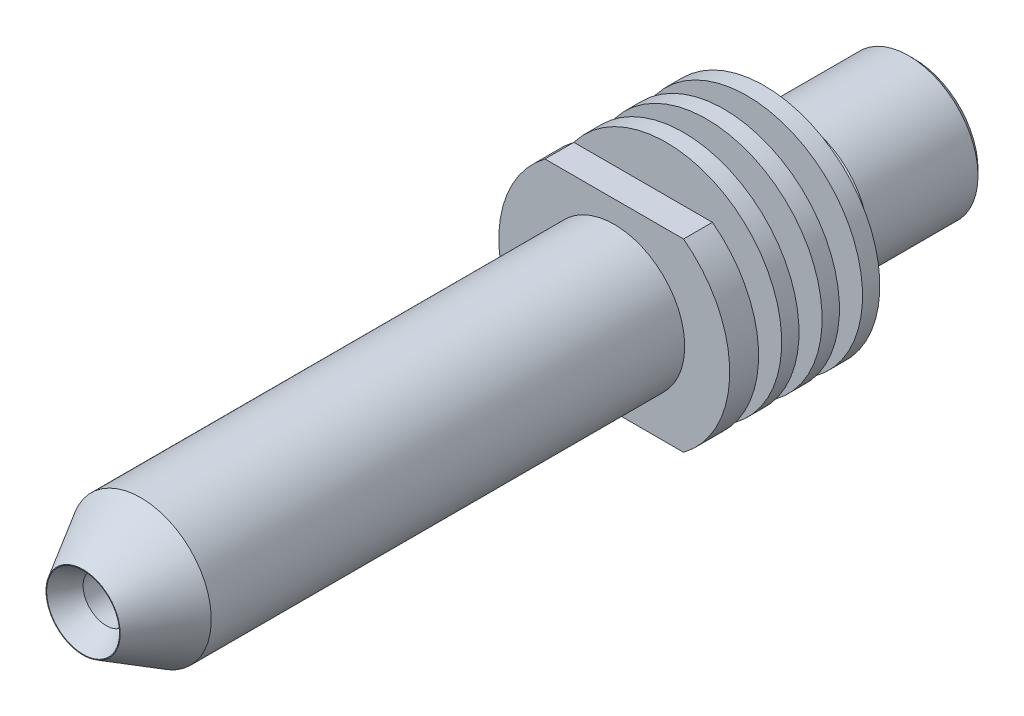
ISO-10303-21;
HEADER;
FILE_DESCRIPTION(('STEP AP214'),'2;1');
FILE_NAME('part.step','',(''),(''),'','','');
FILE_SCHEMA(('AUTOMOTIVE_DESIGN { 1 0 10303 214 1 1 1 1 }'));
ENDSEC;
DATA;
#1=APPLICATION_CONTEXT('core data for automotive mechanical design processes');
#2=APPLICATION_PROTOCOL_DEFINITION('international standard','automotive_design',2000,#1);
#3=PRODUCT_CONTEXT('',#1,'mechanical');
#4=PRODUCT('Part','Part','',(#3));
#5=PRODUCT_RELATED_PRODUCT_CATEGORY('part','',(#4));
#6=PRODUCT_DEFINITION_FORMATION('','',#4);
#7=PRODUCT_DEFINITION_CONTEXT('part definition',#1,'design');
#8=PRODUCT_DEFINITION('design','',#6,#7);
#9=PRODUCT_DEFINITION_SHAPE('','',#8);
#10=(LENGTH_UNIT() NAMED_UNIT(*) SI_UNIT(.MILLI.,.METRE.));
#11=(NAMED_UNIT(*) PLANE_ANGLE_UNIT() SI_UNIT($,.RADIAN.));
#12=(NAMED_UNIT(*) SI_UNIT($,.STERADIAN.) SOLID_ANGLE_UNIT());
#13=UNCERTAINTY_MEASURE_WITH_UNIT(LENGTH_MEASURE(1.E-05),#10,'distance_accuracy_value','');
#14=(GEOMETRIC_REPRESENTATION_CONTEXT(3) GLOBAL_UNCERTAINTY_ASSIGNED_CONTEXT((#13)) GLOBAL_UNIT_ASSIGNED_CONTEXT((#10,
#11,#12)) REPRESENTATION_CONTEXT('',''));
#15=CARTESIAN_POINT('',(0.,0.,0.));
#16=DIRECTION('',(0.,0.,1.));
#17=DIRECTION('',(1.,0.,0.));
#18=AXIS2_PLACEMENT_3D('',#15,#16,#17);
#19=CARTESIAN_POINT('',(-0.2166088223,-17.0652643177,145.88));
#20=DIRECTION('',(0.,0.,1.));
#21=DIRECTION('',(1.,0.,0.));
#22=AXIS2_PLACEMENT_3D('',#19,#20,#21);
#23=PLANE('',#22);
#24=CARTESIAN_POINT('',(-0.2166088223,-17.0652643177,145.88));
#25=DIRECTION('',(0.,0.,-1.));
#26=DIRECTION('',(-1.,0.,0.));
#27=AXIS2_PLACEMENT_3D('',#24,#25,#26);
#28=CIRCLE('',#27,5.);
#29=CARTESIAN_POINT('',(-5.2166088223,-17.0652643177,145.88));
#30=VERTEX_POINT('',#29);
#31=EDGE_CURVE('E19',#30,#30,#28,.T.);
#32=ORIENTED_EDGE('',*,*,#31,.F.);
#33=EDGE_LOOP('',(#32));
#34=FACE_BOUND('',#33,.T.);
#35=CARTESIAN_POINT('',(-0.216608822300001,-17.0652643177,145.88));
#36=DIRECTION('',(0.,0.,-1.));
#37=DIRECTION('',(-1.,0.,0.));
#38=AXIS2_PLACEMENT_3D('',#35,#36,#37);
#39=CIRCLE('',#38,3.);
#40=CARTESIAN_POINT('',(-3.2166088223,-17.0652643177,145.88));
#41=VERTEX_POINT('',#40);
#42=EDGE_CURVE('E155',#41,#41,#39,.F.);
#43=ORIENTED_EDGE('',*,*,#42,.F.);
#44=EDGE_LOOP('',(#43));
#45=FACE_BOUND('',#44,.T.);
#46=ADVANCED_FACE('F16',(#34,#45),#23,.T.);
#47=CARTESIAN_POINT('',(-0.2166088223,-17.0652643177,145.88));
#48=DIRECTION('',(0.,0.,-1.));
#49=DIRECTION('',(-1.,0.,0.));
#50=AXIS2_PLACEMENT_3D('',#47,#48,#49);
#51=CYLINDRICAL_SURFACE('',#50,5.);
#52=CARTESIAN_POINT('',(-0.216608822300001,-17.0652643177,145.13));
#53=DIRECTION('',(0.,0.,-1.));
#54=DIRECTION('',(-1.,0.,0.));
#55=AXIS2_PLACEMENT_3D('',#52,#53,#54);
#56=CIRCLE('',#55,5.);
#57=CARTESIAN_POINT('',(-5.2166088223,-17.0652643177,145.13));
#58=VERTEX_POINT('',#57);
#59=EDGE_CURVE('E153',#58,#58,#56,.F.);
#60=ORIENTED_EDGE('',*,*,#59,.T.);
#61=EDGE_LOOP('',(#60));
#62=FACE_BOUND('',#61,.T.);
#63=ORIENTED_EDGE('',*,*,#31,.T.);
#64=EDGE_LOOP('',(#63));
#65=FACE_BOUND('',#64,.T.);
#66=ADVANCED_FACE('F162',(#62,#65),#51,.T.);
#67=CARTESIAN_POINT('',(-0.2166088223,-17.0652643177,146.88));
#68=DIRECTION('',(0.,0.,-1.));
#69=DIRECTION('',(-1.,0.,0.));
#70=AXIS2_PLACEMENT_3D('',#67,#68,#69);
#71=CYLINDRICAL_SURFACE('',#70,3.);
#72=ORIENTED_EDGE('',*,*,#42,.T.);
#73=EDGE_LOOP('',(#72));
#74=FACE_BOUND('',#73,.T.);
#75=CARTESIAN_POINT('',(-0.2166088223,-17.0652643177,146.88));
#76=DIRECTION('',(0.,0.,-1.));
#77=DIRECTION('',(-1.,0.,0.));
#78=AXIS2_PLACEMENT_3D('',#75,#76,#77);
#79=CIRCLE('',#78,3.);
#80=CARTESIAN_POINT('',(-3.2166088223,-17.0652643177,146.88));
#81=VERTEX_POINT('',#80);
#82=EDGE_CURVE('E150',#81,#81,#79,.T.);
#83=ORIENTED_EDGE('',*,*,#82,.T.);
#84=EDGE_LOOP('',(#83));
#85=FACE_BOUND('',#84,.T.);
#86=ADVANCED_FACE('F170',(#74,#85),#71,.T.);
#87=CARTESIAN_POINT('',(-0.2166088223,-17.0652643177,145.13));
#88=DIRECTION('',(0.,0.,1.));
#89=DIRECTION('',(1.,0.,0.));
#90=AXIS2_PLACEMENT_3D('',#87,#88,#89);
#91=PLANE('',#90);
#92=CARTESIAN_POINT('',(-0.2166088223,-17.0652643177,145.13));
#93=DIRECTION('',(0.,0.,-1.));
#94=DIRECTION('',(-1.,0.,0.));
#95=AXIS2_PLACEMENT_3D('',#92,#93,#94);
#96=CIRCLE('',#95,2.75);
#97=CARTESIAN_POINT('',(-2.9666088223,-17.0652643177,145.13));
#98=VERTEX_POINT('',#97);
#99=EDGE_CURVE('E147',#98,#98,#96,.T.);
#100=ORIENTED_EDGE('',*,*,#99,.F.);
#101=EDGE_LOOP('',(#100));
#102=FACE_BOUND('',#101,.T.);
#103=ORIENTED_EDGE('',*,*,#59,.F.);
#104=EDGE_LOOP('',(#103));
#105=FACE_BOUND('',#104,.T.);
#106=ADVANCED_FACE('F273',(#102,#105),#91,.F.);
#107=CARTESIAN_POINT('',(-0.2166088223,-17.0652643177,146.88));
#108=DIRECTION('',(0.,0.,1.));
#109=DIRECTION('',(1.,0.,0.));
#110=AXIS2_PLACEMENT_3D('',#107,#108,#109);
#111=PLANE('',#110);
#112=ORIENTED_EDGE('',*,*,#82,.F.);
#113=EDGE_LOOP('',(#112));
#114=FACE_BOUND('',#113,.T.);
#115=CARTESIAN_POINT('',(-0.216608822300001,-17.0652643177,146.88));
#116=DIRECTION('',(0.,0.,-1.));
#117=DIRECTION('',(-1.,0.,0.));
#118=AXIS2_PLACEMENT_3D('',#115,#116,#117);
#119=CIRCLE('',#118,5.);
#120=CARTESIAN_POINT('',(-5.2166088223,-17.0652643177,146.88));
#121=VERTEX_POINT('',#120);
#122=EDGE_CURVE('E107',#121,#121,#119,.F.);
#123=ORIENTED_EDGE('',*,*,#122,.F.);
#124=EDGE_LOOP('',(#123));
#125=FACE_BOUND('',#124,.T.);
#126=ADVANCED_FACE('F269',(#114,#125),#111,.F.);
#127=CARTESIAN_POINT('',(-0.2166088223,-17.0652643177,145.13));
#128=DIRECTION('',(0.,0.,-1.));
#129=DIRECTION('',(-1.,0.,0.));
#130=AXIS2_PLACEMENT_3D('',#127,#128,#129);
#131=CYLINDRICAL_SURFACE('',#130,2.75);
#132=CARTESIAN_POINT('',(-0.2166088223,-17.0652643177,143.880000000024));
#133=DIRECTION('',(0.,0.,-1.));
#134=DIRECTION('',(0.,1.,0.));
#135=AXIS2_PLACEMENT_3D('',#132,#133,#134);
#136=CIRCLE('',#135,2.75000000005504);
#137=CARTESIAN_POINT('',(-0.216608822299999,-14.315264317645,143.880000000024));
#138=VERTEX_POINT('',#137);
#139=EDGE_CURVE('E104',#138,#138,#136,.T.);
#140=ORIENTED_EDGE('',*,*,#139,.F.);
#141=EDGE_LOOP('',(#140));
#142=FACE_BOUND('',#141,.T.);
#143=ORIENTED_EDGE('',*,*,#99,.T.);
#144=EDGE_LOOP('',(#143));
#145=FACE_BOUND('',#144,.T.);
#146=ADVANCED_FACE('F265',(#142,#145),#131,.T.);
#147=CARTESIAN_POINT('',(-0.2166088223,-17.0652643177,147.63));
#148=DIRECTION('',(0.,0.,-1.));
#149=DIRECTION('',(-1.,0.,0.));
#150=AXIS2_PLACEMENT_3D('',#147,#148,#149);
#151=CYLINDRICAL_SURFACE('',#150,5.);
#152=ORIENTED_EDGE('',*,*,#122,.T.);
#153=EDGE_LOOP('',(#152));
#154=FACE_BOUND('',#153,.T.);
#155=CARTESIAN_POINT('',(-0.2166088223,-17.0652643177,147.63));
#156=DIRECTION('',(0.,0.,-1.));
#157=DIRECTION('',(-1.,0.,0.));
#158=AXIS2_PLACEMENT_3D('',#155,#156,#157);
#159=CIRCLE('',#158,5.);
#160=CARTESIAN_POINT('',(-5.2166088223,-17.0652643177,147.63));
#161=VERTEX_POINT('',#160);
#162=EDGE_CURVE('E99',#161,#161,#159,.F.);
#163=ORIENTED_EDGE('',*,*,#162,.F.);
#164=EDGE_LOOP('',(#163));
#165=FACE_BOUND('',#164,.T.);
#166=ADVANCED_FACE('F261',(#154,#165),#151,.T.);
#167=CARTESIAN_POINT('',(-0.2166088223,-17.0652643177,143.63000000003));
#168=DIRECTION('',(0.,0.,-1.));
#169=DIRECTION('',(-1.,0.,0.));
#170=AXIS2_PLACEMENT_3D('',#167,#168,#169);
#171=CONICAL_SURFACE('',#170,3.00000000004913,0.785398163397448);
#172=CARTESIAN_POINT('',(-0.2166088223,-17.0652643177,143.63));
#173=DIRECTION('',(0.,0.,-1.));
#174=DIRECTION('',(-1.,0.,0.));
#175=AXIS2_PLACEMENT_3D('',#172,#173,#174);
#176=CIRCLE('',#175,3.);
#177=CARTESIAN_POINT('',(-3.2166088223,-17.0652643177,143.63));
#178=VERTEX_POINT('',#177);
#179=EDGE_CURVE('E95',#178,#178,#176,.T.);
#180=ORIENTED_EDGE('',*,*,#179,.F.);
#181=EDGE_LOOP('',(#180));
#182=FACE_BOUND('',#181,.T.);
#183=ORIENTED_EDGE('',*,*,#139,.T.);
#184=EDGE_LOOP('',(#183));
#185=FACE_BOUND('',#184,.T.);
#186=ADVANCED_FACE('F257',(#182,#185),#171,.T.);
#187=CARTESIAN_POINT('',(-0.2166088223,-17.0652643177,147.63));
#188=DIRECTION('',(0.,0.,1.));
#189=DIRECTION('',(1.,0.,0.));
#190=AXIS2_PLACEMENT_3D('',#187,#188,#189);
#191=PLANE('',#190);
#192=ORIENTED_EDGE('',*,*,#162,.T.);
#193=EDGE_LOOP('',(#192));
#194=FACE_BOUND('',#193,.T.);
#195=CARTESIAN_POINT('',(-0.216608822300001,-17.0652643177,147.63));
#196=DIRECTION('',(0.,0.,-1.));
#197=DIRECTION('',(-1.,0.,0.));
#198=AXIS2_PLACEMENT_3D('',#195,#196,#197);
#199=CIRCLE('',#198,3.);
#200=CARTESIAN_POINT('',(-3.2166088223,-17.0652643177,147.63));
#201=VERTEX_POINT('',#200);
#202=EDGE_CURVE('E98',#201,#201,#199,.F.);
#203=ORIENTED_EDGE('',*,*,#202,.F.);
#204=EDGE_LOOP('',(#203));
#205=FACE_BOUND('',#204,.T.);
#206=ADVANCED_FACE('F253',(#194,#205),#191,.T.);
#207=CARTESIAN_POINT('',(-0.2166088223,-17.0652643177,143.63));
#208=DIRECTION('',(0.,0.,-1.));
#209=DIRECTION('',(-1.,0.,0.));
#210=AXIS2_PLACEMENT_3D('',#207,#208,#209);
#211=CYLINDRICAL_SURFACE('',#210,3.);
#212=CARTESIAN_POINT('',(-0.2166088223,-17.0652643177,138.879999999972));
#213=DIRECTION('',(0.,0.,1.));
#214=DIRECTION('',(0.,1.,0.));
#215=AXIS2_PLACEMENT_3D('',#212,#213,#214);
#216=CIRCLE('',#215,2.99999999999228);
#217=CARTESIAN_POINT('',(-0.2166088223,-14.0652643177077,138.879999999972));
#218=VERTEX_POINT('',#217);
#219=EDGE_CURVE('E100',#218,#218,#216,.F.);
#220=ORIENTED_EDGE('',*,*,#219,.F.);
#221=EDGE_LOOP('',(#220));
#222=FACE_BOUND('',#221,.T.);
#223=ORIENTED_EDGE('',*,*,#179,.T.);
#224=EDGE_LOOP('',(#223));
#225=FACE_BOUND('',#224,.T.);
#226=ADVANCED_FACE('F249',(#222,#225),#211,.T.);
#227=CARTESIAN_POINT('',(-0.2166088223,-17.0652643177,148.63));
#228=DIRECTION('',(0.,0.,-1.));
#229=DIRECTION('',(-1.,0.,0.));
#230=AXIS2_PLACEMENT_3D('',#227,#228,#229);
#231=CYLINDRICAL_SURFACE('',#230,3.);
#232=ORIENTED_EDGE('',*,*,#202,.T.);
#233=EDGE_LOOP('',(#232));
#234=FACE_BOUND('',#233,.T.);
#235=CARTESIAN_POINT('',(-0.2166088223,-17.0652643177,148.63));
#236=DIRECTION('',(0.,0.,-1.));
#237=DIRECTION('',(-1.,0.,0.));
#238=AXIS2_PLACEMENT_3D('',#235,#236,#237);
#239=CIRCLE('',#238,3.);
#240=CARTESIAN_POINT('',(-3.2166088223,-17.0652643177,148.63));
#241=VERTEX_POINT('',#240);
#242=EDGE_CURVE('E103',#241,#241,#239,.T.);
#243=ORIENTED_EDGE('',*,*,#242,.T.);
#244=EDGE_LOOP('',(#243));
#245=FACE_BOUND('',#244,.T.);
#246=ADVANCED_FACE('F245',(#234,#245),#231,.T.);
#247=CARTESIAN_POINT('',(-0.2166088223,-17.0652643177,138.879999999972));
#248=DIRECTION('',(0.,0.,1.));
#249=DIRECTION('',(1.,0.,0.));
#250=AXIS2_PLACEMENT_3D('',#247,#248,#249);
#251=CONICAL_SURFACE('',#250,2.99999999999228,0.785398163397448);
#252=CARTESIAN_POINT('',(-0.2166088223,-17.0652643177,138.629999999978));
#253=DIRECTION('',(0.,0.,1.));
#254=DIRECTION('',(1.,0.,0.));
#255=AXIS2_PLACEMENT_3D('',#252,#253,#254);
#256=CIRCLE('',#255,2.74999999999819);
#257=CARTESIAN_POINT('',(2.53339117769819,-17.0652643177,138.629999999978));
#258=VERTEX_POINT('',#257);
#259=EDGE_CURVE('E136',#258,#258,#256,.T.);
#260=ORIENTED_EDGE('',*,*,#259,.T.);
#261=EDGE_LOOP('',(#260));
#262=FACE_BOUND('',#261,.T.);
#263=ORIENTED_EDGE('',*,*,#219,.T.);
#264=EDGE_LOOP('',(#263));
#265=FACE_BOUND('',#264,.T.);
#266=ADVANCED_FACE('F241',(#262,#265),#251,.T.);
#267=CARTESIAN_POINT('',(-0.2166088223,-17.0652643177,148.63));
#268=DIRECTION('',(0.,0.,1.));
#269=DIRECTION('',(1.,0.,0.));
#270=AXIS2_PLACEMENT_3D('',#267,#268,#269);
#271=PLANE('',#270);
#272=ORIENTED_EDGE('',*,*,#242,.F.);
#273=EDGE_LOOP('',(#272));
#274=FACE_BOUND('',#273,.T.);
#275=CARTESIAN_POINT('',(-0.216608822300001,-17.0652643177,148.63));
#276=DIRECTION('',(0.,0.,-1.));
#277=DIRECTION('',(-1.,0.,0.));
#278=AXIS2_PLACEMENT_3D('',#275,#276,#277);
#279=CIRCLE('',#278,5.);
#280=CARTESIAN_POINT('',(-5.2166088223,-17.0652643177,148.63));
#281=VERTEX_POINT('',#280);
#282=EDGE_CURVE('E133',#281,#281,#279,.F.);
#283=ORIENTED_EDGE('',*,*,#282,.F.);
#284=EDGE_LOOP('',(#283));
#285=FACE_BOUND('',#284,.T.);
#286=ADVANCED_FACE('F237',(#274,#285),#271,.F.);
#287=CARTESIAN_POINT('',(-0.2166088223,-17.0652643177,138.63));
#288=DIRECTION('',(0.,0.,1.));
#289=DIRECTION('',(1.,0.,0.));
#290=AXIS2_PLACEMENT_3D('',#287,#288,#289);
#291=PLANE('',#290);
#292=CARTESIAN_POINT('',(-0.2166088223,-17.0652643177,138.63));
#293=DIRECTION('',(0.,0.,1.));
#294=DIRECTION('',(1.,0.,0.));
#295=AXIS2_PLACEMENT_3D('',#292,#293,#294);
#296=CIRCLE('',#295,2.);
#297=CARTESIAN_POINT('',(1.7833911777,-17.0652643177,138.63));
#298=VERTEX_POINT('',#297);
#299=EDGE_CURVE('E130',#298,#298,#296,.T.);
#300=ORIENTED_EDGE('',*,*,#299,.T.);
#301=EDGE_LOOP('',(#300));
#302=FACE_BOUND('',#301,.T.);
#303=ORIENTED_EDGE('',*,*,#259,.F.);
#304=EDGE_LOOP('',(#303));
#305=FACE_BOUND('',#304,.T.);
#306=ADVANCED_FACE('F233',(#302,#305),#291,.F.);
#307=CARTESIAN_POINT('',(-0.2166088223,-17.0652643177,149.38));
#308=DIRECTION('',(0.,0.,-1.));
#309=DIRECTION('',(-1.,0.,0.));
#310=AXIS2_PLACEMENT_3D('',#307,#308,#309);
#311=CYLINDRICAL_SURFACE('',#310,5.);
#312=ORIENTED_EDGE('',*,*,#282,.T.);
#313=EDGE_LOOP('',(#312));
#314=FACE_BOUND('',#313,.T.);
#315=CARTESIAN_POINT('',(-0.2166088223,-17.0652643177,149.38));
#316=DIRECTION('',(0.,0.,-1.));
#317=DIRECTION('',(-1.,0.,0.));
#318=AXIS2_PLACEMENT_3D('',#315,#316,#317);
#319=CIRCLE('',#318,5.);
#320=CARTESIAN_POINT('',(-5.2166088223,-17.0652643177,149.38));
#321=VERTEX_POINT('',#320);
#322=EDGE_CURVE('E94',#321,#321,#319,.F.);
#323=ORIENTED_EDGE('',*,*,#322,.F.);
#324=EDGE_LOOP('',(#323));
#325=FACE_BOUND('',#324,.T.);
#326=ADVANCED_FACE('F229',(#314,#325),#311,.T.);
#327=CARTESIAN_POINT('',(-0.2166088223,-17.0652643177,138.63));
#328=DIRECTION('',(0.,0.,1.));
#329=DIRECTION('',(1.,0.,0.));
#330=AXIS2_PLACEMENT_3D('',#327,#328,#329);
#331=CYLINDRICAL_SURFACE('',#330,2.);
#332=CARTESIAN_POINT('',(-0.2166088223,-17.0652643177,169.629999999984));
#333=DIRECTION('',(0.,0.,-1.));
#334=DIRECTION('',(0.,1.,0.));
#335=AXIS2_PLACEMENT_3D('',#332,#333,#334);
#336=CIRCLE('',#335,2.00000000001593);
#337=CARTESIAN_POINT('',(-0.216608822299993,-15.0652643176841,169.629999999984));
#338=VERTEX_POINT('',#337);
#339=EDGE_CURVE('E91',#338,#338,#336,.F.);
#340=ORIENTED_EDGE('',*,*,#339,.T.);
#341=EDGE_LOOP('',(#340));
#342=FACE_BOUND('',#341,.T.);
#343=ORIENTED_EDGE('',*,*,#299,.F.);
#344=EDGE_LOOP('',(#343));
#345=FACE_BOUND('',#344,.T.);
#346=ADVANCED_FACE('F225',(#342,#345),#331,.F.);
#347=CARTESIAN_POINT('',(-0.2166088223,-17.0652643177,149.38));
#348=DIRECTION('',(0.,0.,1.));
#349=DIRECTION('',(1.,0.,0.));
#350=AXIS2_PLACEMENT_3D('',#347,#348,#349);
#351=PLANE('',#350);
#352=ORIENTED_EDGE('',*,*,#322,.T.);
#353=EDGE_LOOP('',(#352));
#354=FACE_BOUND('',#353,.T.);
#355=CARTESIAN_POINT('',(-0.216608822300001,-17.0652643177,149.38));
#356=DIRECTION('',(0.,0.,-1.));
#357=DIRECTION('',(-1.,0.,0.));
#358=AXIS2_PLACEMENT_3D('',#355,#356,#357);
#359=CIRCLE('',#358,3.);
#360=CARTESIAN_POINT('',(-3.2166088223,-17.0652643177,149.38));
#361=VERTEX_POINT('',#360);
#362=EDGE_CURVE('E88',#361,#361,#359,.F.);
#363=ORIENTED_EDGE('',*,*,#362,.F.);
#364=EDGE_LOOP('',(#363));
#365=FACE_BOUND('',#364,.T.);
#366=ADVANCED_FACE('F221',(#354,#365),#351,.T.);
#367=CARTESIAN_POINT('',(-0.2166088223,-17.0652643177,169.629999999984));
#368=DIRECTION('',(0.,0.,-1.));
#369=DIRECTION('',(-1.,0.,0.));
#370=AXIS2_PLACEMENT_3D('',#367,#368,#369);
#371=CONICAL_SURFACE('',#370,2.00000000001593,1.04719755120245);
#372=CARTESIAN_POINT('',(-0.2166088223,-17.0652643177,170.20735026919));
#373=DIRECTION('',(0.,0.,1.));
#374=DIRECTION('',(1.,0.,0.));
#375=AXIS2_PLACEMENT_3D('',#372,#373,#374);
#376=CIRCLE('',#375,1.);
#377=CARTESIAN_POINT('',(0.7833911777,-17.0652643177,170.20735026919));
#378=VERTEX_POINT('',#377);
#379=EDGE_CURVE('E84',#378,#378,#376,.T.);
#380=ORIENTED_EDGE('',*,*,#379,.T.);
#381=EDGE_LOOP('',(#380));
#382=FACE_BOUND('',#381,.T.);
#383=ORIENTED_EDGE('',*,*,#339,.F.);
#384=EDGE_LOOP('',(#383));
#385=FACE_BOUND('',#384,.T.);
#386=ADVANCED_FACE('F217',(#382,#385),#371,.F.);
#387=CARTESIAN_POINT('',(-0.2166088223,-17.0652643177,150.38));
#388=DIRECTION('',(0.,0.,-1.));
#389=DIRECTION('',(-1.,0.,0.));
#390=AXIS2_PLACEMENT_3D('',#387,#388,#389);
#391=CYLINDRICAL_SURFACE('',#390,3.);
#392=ORIENTED_EDGE('',*,*,#362,.T.);
#393=EDGE_LOOP('',(#392));
#394=FACE_BOUND('',#393,.T.);
#395=CARTESIAN_POINT('',(-0.2166088223,-17.0652643177,150.38));
#396=DIRECTION('',(0.,0.,-1.));
#397=DIRECTION('',(-1.,0.,0.));
#398=AXIS2_PLACEMENT_3D('',#395,#396,#397);
#399=CIRCLE('',#398,3.);
#400=CARTESIAN_POINT('',(-3.2166088223,-17.0652643177,150.38));
#401=VERTEX_POINT('',#400);
#402=EDGE_CURVE('E87',#401,#401,#399,.T.);
#403=ORIENTED_EDGE('',*,*,#402,.T.);
#404=EDGE_LOOP('',(#403));
#405=FACE_BOUND('',#404,.T.);
#406=ADVANCED_FACE('F213',(#394,#405),#391,.T.);
#407=CARTESIAN_POINT('',(-0.2166088223,-17.0652643177,170.20735026919));
#408=DIRECTION('',(0.,0.,1.));
#409=DIRECTION('',(1.,0.,0.));
#410=AXIS2_PLACEMENT_3D('',#407,#408,#409);
#411=CYLINDRICAL_SURFACE('',#410,1.);
#412=CARTESIAN_POINT('',(-0.2166088223,-17.0652643177,173.629999999946));
#413=DIRECTION('',(0.,0.,1.));
#414=DIRECTION('',(0.,1.,0.));
#415=AXIS2_PLACEMENT_3D('',#412,#413,#414);
#416=CIRCLE('',#415,0.999999999982733);
#417=CARTESIAN_POINT('',(-0.216608822299992,-16.0652643177173,173.629999999946));
#418=VERTEX_POINT('',#417);
#419=EDGE_CURVE('E83',#418,#418,#416,.T.);
#420=ORIENTED_EDGE('',*,*,#419,.T.);
#421=EDGE_LOOP('',(#420));
#422=FACE_BOUND('',#421,.T.);
#423=ORIENTED_EDGE('',*,*,#379,.F.);
#424=EDGE_LOOP('',(#423));
#425=FACE_BOUND('',#424,.T.);
#426=ADVANCED_FACE('F209',(#422,#425),#411,.F.);
#427=CARTESIAN_POINT('',(-0.2166088223,-17.0652643177,150.38));
#428=DIRECTION('',(0.,0.,1.));
#429=DIRECTION('',(1.,0.,0.));
#430=AXIS2_PLACEMENT_3D('',#427,#428,#429);
#431=PLANE('',#430);
#432=ORIENTED_EDGE('',*,*,#402,.F.);
#433=EDGE_LOOP('',(#432));
#434=FACE_BOUND('',#433,.T.);
#435=DIRECTION('',(1.,0.,0.));
#436=VECTOR('',#435,1.);
#437=CARTESIAN_POINT('',(-4.7166088223,-21.0652643177,150.38));
#438=LINE('',#437,#436);
#439=CARTESIAN_POINT('',(-3.2166088223,-21.0652643177,150.38));
#440=VERTEX_POINT('',#439);
#441=CARTESIAN_POINT('',(2.7833911777,-21.0652643177,150.38));
#442=VERTEX_POINT('',#441);
#443=EDGE_CURVE('E54',#440,#442,#438,.T.);
#444=ORIENTED_EDGE('',*,*,#443,.F.);
#445=CARTESIAN_POINT('',(-0.216608822300001,-17.0652643177,150.38));
#446=DIRECTION('',(0.,0.,-1.));
#447=DIRECTION('',(-1.,0.,0.));
#448=AXIS2_PLACEMENT_3D('',#445,#446,#447);
#449=CIRCLE('',#448,5.);
#450=CARTESIAN_POINT('',(-3.2166088223,-13.0652643177,150.38));
#451=VERTEX_POINT('',#450);
#452=EDGE_CURVE('E71',#451,#440,#449,.F.);
#453=ORIENTED_EDGE('',*,*,#452,.F.);
#454=DIRECTION('',(1.,0.,0.));
#455=VECTOR('',#454,1.);
#456=CARTESIAN_POINT('',(4.2833911777,-13.0652643177,150.38));
#457=LINE('',#456,#455);
#458=CARTESIAN_POINT('',(2.7833911777,-13.0652643177,150.38));
#459=VERTEX_POINT('',#458);
#460=EDGE_CURVE('E68',#459,#451,#457,.F.);
#461=ORIENTED_EDGE('',*,*,#460,.F.);
#462=CARTESIAN_POINT('',(-0.216608822300001,-17.0652643177,150.38));
#463=DIRECTION('',(0.,0.,-1.));
#464=DIRECTION('',(-1.,0.,0.));
#465=AXIS2_PLACEMENT_3D('',#462,#463,#464);
#466=CIRCLE('',#465,5.);
#467=EDGE_CURVE('E59',#442,#459,#466,.F.);
#468=ORIENTED_EDGE('',*,*,#467,.F.);
#469=EDGE_LOOP('',(#444,#453,#461,#468));
#470=FACE_BOUND('',#469,.T.);
#471=ADVANCED_FACE('F69',(#434,#470),#431,.F.);
#472=CARTESIAN_POINT('',(-0.216608822299999,-17.0652643177,174.629999999979));
#473=DIRECTION('',(0.,0.,1.));
#474=DIRECTION('',(1.,0.,0.));
#475=AXIS2_PLACEMENT_3D('',#472,#473,#474);
#476=CONICAL_SURFACE('',#475,1.57735026920774,0.523598775610461);
#477=CARTESIAN_POINT('',(-0.216608822299999,-17.0652643177,174.629999999979));
#478=DIRECTION('',(0.,0.,1.));
#479=DIRECTION('',(1.,0.,0.));
#480=AXIS2_PLACEMENT_3D('',#477,#478,#479);
#481=CIRCLE('',#480,1.57735026920774);
#482=CARTESIAN_POINT('',(1.36074144690774,-17.0652643177,174.629999999979));
#483=VERTEX_POINT('',#482);
#484=EDGE_CURVE('E119',#483,#483,#481,.F.);
#485=ORIENTED_EDGE('',*,*,#484,.F.);
#486=EDGE_LOOP('',(#485));
#487=FACE_BOUND('',#486,.T.);
#488=ORIENTED_EDGE('',*,*,#419,.F.);
#489=EDGE_LOOP('',(#488));
#490=FACE_BOUND('',#489,.T.);
#491=ADVANCED_FACE('F203',(#487,#490),#476,.F.);
#492=CARTESIAN_POINT('',(-4.7166088223,-21.0652643177,151.63));
#493=DIRECTION('',(0.,-1.,0.));
#494=DIRECTION('',(0.,0.,-1.));
#495=AXIS2_PLACEMENT_3D('',#492,#493,#494);
#496=PLANE('',#495);
#497=ORIENTED_EDGE('',*,*,#443,.T.);
#498=DIRECTION('',(0.,0.,-1.));
#499=VECTOR('',#498,1.);
#500=CARTESIAN_POINT('',(2.7833911777,-21.0652643177,151.63));
#501=LINE('',#500,#499);
#502=CARTESIAN_POINT('',(2.7833911777,-21.0652643177,151.63));
#503=VERTEX_POINT('',#502);
#504=EDGE_CURVE('E65',#503,#442,#501,.T.);
#505=ORIENTED_EDGE('',*,*,#504,.F.);
#506=DIRECTION('',(1.,0.,0.));
#507=VECTOR('',#506,1.);
#508=CARTESIAN_POINT('',(-0.2166088223,-21.0652643177,151.63));
#509=LINE('',#508,#507);
#510=CARTESIAN_POINT('',(-3.2166088223,-21.0652643177,151.63));
#511=VERTEX_POINT('',#510);
#512=EDGE_CURVE('E118',#511,#503,#509,.T.);
#513=ORIENTED_EDGE('',*,*,#512,.F.);
#514=DIRECTION('',(0.,0.,-1.));
#515=VECTOR('',#514,1.);
#516=CARTESIAN_POINT('',(-3.2166088223,-21.0652643177,151.63));
#517=LINE('',#516,#515);
#518=EDGE_CURVE('E122',#440,#511,#517,.F.);
#519=ORIENTED_EDGE('',*,*,#518,.F.);
#520=EDGE_LOOP('',(#497,#505,#513,#519));
#521=FACE_BOUND('',#520,.T.);
#522=ADVANCED_FACE('F200',(#521),#496,.T.);
#523=CARTESIAN_POINT('',(-0.2166088223,-17.0652643177,151.63));
#524=DIRECTION('',(0.,0.,-1.));
#525=DIRECTION('',(-1.,0.,0.));
#526=AXIS2_PLACEMENT_3D('',#523,#524,#525);
#527=CYLINDRICAL_SURFACE('',#526,5.);
#528=DIRECTION('',(0.,0.,1.));
#529=VECTOR('',#528,1.);
#530=CARTESIAN_POINT('',(2.7833911777,-13.0652643177,151.63));
#531=LINE('',#530,#529);
#532=CARTESIAN_POINT('',(2.7833911777,-13.0652643177,151.63));
#533=VERTEX_POINT('',#532);
#534=EDGE_CURVE('E64',#533,#459,#531,.F.);
#535=ORIENTED_EDGE('',*,*,#534,.F.);
#536=CARTESIAN_POINT('',(-0.2166088223,-17.0652643177,151.63));
#537=DIRECTION('',(0.,0.,-1.));
#538=DIRECTION('',(-1.,0.,0.));
#539=AXIS2_PLACEMENT_3D('',#536,#537,#538);
#540=CIRCLE('',#539,5.);
#541=EDGE_CURVE('E116',#503,#533,#540,.F.);
#542=ORIENTED_EDGE('',*,*,#541,.F.);
#543=ORIENTED_EDGE('',*,*,#504,.T.);
#544=ORIENTED_EDGE('',*,*,#467,.T.);
#545=EDGE_LOOP('',(#535,#542,#543,#544));
#546=FACE_BOUND('',#545,.T.);
#547=ADVANCED_FACE('F61',(#546),#527,.T.);
#548=CARTESIAN_POINT('',(4.2833911777,-13.0652643177,151.63));
#549=DIRECTION('',(0.,1.,0.));
#550=DIRECTION('',(0.,0.,1.));
#551=AXIS2_PLACEMENT_3D('',#548,#549,#550);
#552=PLANE('',#551);
#553=ORIENTED_EDGE('',*,*,#460,.T.);
#554=DIRECTION('',(0.,0.,-1.));
#555=VECTOR('',#554,1.);
#556=CARTESIAN_POINT('',(-3.2166088223,-13.0652643177,151.63));
#557=LINE('',#556,#555);
#558=CARTESIAN_POINT('',(-3.2166088223,-13.0652643177,151.63));
#559=VERTEX_POINT('',#558);
#560=EDGE_CURVE('E34',#559,#451,#557,.T.);
#561=ORIENTED_EDGE('',*,*,#560,.F.);
#562=DIRECTION('',(1.,0.,0.));
#563=VECTOR('',#562,1.);
#564=CARTESIAN_POINT('',(-0.2166088223,-13.0652643177,151.63));
#565=LINE('',#564,#563);
#566=EDGE_CURVE('E75',#533,#559,#565,.F.);
#567=ORIENTED_EDGE('',*,*,#566,.F.);
#568=ORIENTED_EDGE('',*,*,#534,.T.);
#569=EDGE_LOOP('',(#553,#561,#567,#568));
#570=FACE_BOUND('',#569,.T.);
#571=ADVANCED_FACE('F73',(#570),#552,.T.);
#572=CARTESIAN_POINT('',(-0.2166088223,-17.0652643177,151.63));
#573=DIRECTION('',(0.,0.,-1.));
#574=DIRECTION('',(-1.,0.,0.));
#575=AXIS2_PLACEMENT_3D('',#572,#573,#574);
#576=CYLINDRICAL_SURFACE('',#575,5.);
#577=CARTESIAN_POINT('',(-0.2166088223,-17.0652643177,151.63));
#578=DIRECTION('',(0.,0.,-1.));
#579=DIRECTION('',(-1.,0.,0.));
#580=AXIS2_PLACEMENT_3D('',#577,#578,#579);
#581=CIRCLE('',#580,5.);
#582=EDGE_CURVE('E113',#559,#511,#581,.F.);
#583=ORIENTED_EDGE('',*,*,#582,.F.);
#584=ORIENTED_EDGE('',*,*,#560,.T.);
#585=ORIENTED_EDGE('',*,*,#452,.T.);
#586=ORIENTED_EDGE('',*,*,#518,.T.);
#587=EDGE_LOOP('',(#583,#584,#585,#586));
#588=FACE_BOUND('',#587,.T.);
#589=ADVANCED_FACE('F191',(#588),#576,.T.);
#590=CARTESIAN_POINT('',(-0.2166088223,-17.0652643177,174.63));
#591=DIRECTION('',(0.,0.,1.));
#592=DIRECTION('',(1.,0.,0.));
#593=AXIS2_PLACEMENT_3D('',#590,#591,#592);
#594=PLANE('',#593);
#595=ORIENTED_EDGE('',*,*,#484,.T.);
#596=EDGE_LOOP('',(#595));
#597=FACE_BOUND('',#596,.T.);
#598=CARTESIAN_POINT('',(-0.216608822300002,-17.0652643177,174.629999999979));
#599=DIRECTION('',(0.,0.,-1.));
#600=DIRECTION('',(-1.,0.,0.));
#601=AXIS2_PLACEMENT_3D('',#598,#599,#600);
#602=CIRCLE('',#601,1.60655026917949);
#603=CARTESIAN_POINT('',(-1.82315909147949,-17.0652643177,174.629999999979));
#604=VERTEX_POINT('',#603);
#605=EDGE_CURVE('E110',#604,#604,#602,.T.);
#606=ORIENTED_EDGE('',*,*,#605,.F.);
#607=EDGE_LOOP('',(#606));
#608=FACE_BOUND('',#607,.T.);
#609=ADVANCED_FACE('F187',(#597,#608),#594,.T.);
#610=CARTESIAN_POINT('',(-0.2166088223,-17.0652643177,151.63));
#611=DIRECTION('',(0.,0.,1.));
#612=DIRECTION('',(1.,0.,0.));
#613=AXIS2_PLACEMENT_3D('',#610,#611,#612);
#614=PLANE('',#613);
#615=CARTESIAN_POINT('',(-0.216608822300014,-17.0652643177,151.63));
#616=DIRECTION('',(0.,0.,-1.));
#617=DIRECTION('',(-1.,0.,0.));
#618=AXIS2_PLACEMENT_3D('',#615,#616,#617);
#619=CIRCLE('',#618,3.05);
#620=CARTESIAN_POINT('',(-3.26660882230001,-17.0652643177,151.63));
#621=VERTEX_POINT('',#620);
#622=EDGE_CURVE('E25',#621,#621,#619,.F.);
#623=ORIENTED_EDGE('',*,*,#622,.F.);
#624=EDGE_LOOP('',(#623));
#625=FACE_BOUND('',#624,.T.);
#626=ORIENTED_EDGE('',*,*,#566,.T.);
#627=ORIENTED_EDGE('',*,*,#582,.T.);
#628=ORIENTED_EDGE('',*,*,#512,.T.);
#629=ORIENTED_EDGE('',*,*,#541,.T.);
#630=EDGE_LOOP('',(#626,#627,#628,#629));
#631=FACE_BOUND('',#630,.T.);
#632=ADVANCED_FACE('F180',(#625,#631),#614,.T.);
#633=CARTESIAN_POINT('',(-0.216608822300002,-17.0652643177,172.129871728032));
#634=DIRECTION('',(0.,0.,-1.));
#635=DIRECTION('',(-1.,0.,0.));
#636=AXIS2_PLACEMENT_3D('',#633,#634,#635);
#637=CONICAL_SURFACE('',#636,3.04999999997973,0.523598775593172);
#638=CARTESIAN_POINT('',(-0.2166088223,-17.0652643177,172.12987172806));
#639=DIRECTION('',(0.,0.,-1.));
#640=DIRECTION('',(-1.,0.,0.));
#641=AXIS2_PLACEMENT_3D('',#638,#639,#640);
#642=CIRCLE('',#641,3.05);
#643=CARTESIAN_POINT('',(-3.2666088223,-17.0652643177,172.12987172806));
#644=VERTEX_POINT('',#643);
#645=EDGE_CURVE('E11',#644,#644,#642,.T.);
#646=ORIENTED_EDGE('',*,*,#645,.F.);
#647=EDGE_LOOP('',(#646));
#648=FACE_BOUND('',#647,.T.);
#649=ORIENTED_EDGE('',*,*,#605,.T.);
#650=EDGE_LOOP('',(#649));
#651=FACE_BOUND('',#650,.T.);
#652=ADVANCED_FACE('F174',(#648,#651),#637,.T.);
#653=CARTESIAN_POINT('',(-0.2166088223,-17.0652643177,172.12987172806));
#654=DIRECTION('',(0.,0.,-1.));
#655=DIRECTION('',(-1.,0.,0.));
#656=AXIS2_PLACEMENT_3D('',#653,#654,#655);
#657=CYLINDRICAL_SURFACE('',#656,3.05);
#658=ORIENTED_EDGE('',*,*,#622,.T.);
#659=EDGE_LOOP('',(#658));
#660=FACE_BOUND('',#659,.T.);
#661=ORIENTED_EDGE('',*,*,#645,.T.);
#662=EDGE_LOOP('',(#661));
#663=FACE_BOUND('',#662,.T.);
#664=ADVANCED_FACE('F172',(#660,#663),#657,.T.);
#665=CLOSED_SHELL('',(#46,#66,#86,#106,#126,#146,#166,#186,#206,#226,#246,#266,#286,#306,#326,
#346,#366,#386,#406,#426,#471,#491,#522,#547,#571,#589,#609,#632,#652,#664));
#666=MANIFOLD_SOLID_BREP('B1',#665);
#667=ADVANCED_BREP_SHAPE_REPRESENTATION('',(#18,#666),#14);
#668=SHAPE_DEFINITION_REPRESENTATION(#9,#667);
ENDSEC;
END-ISO-10303-21;
